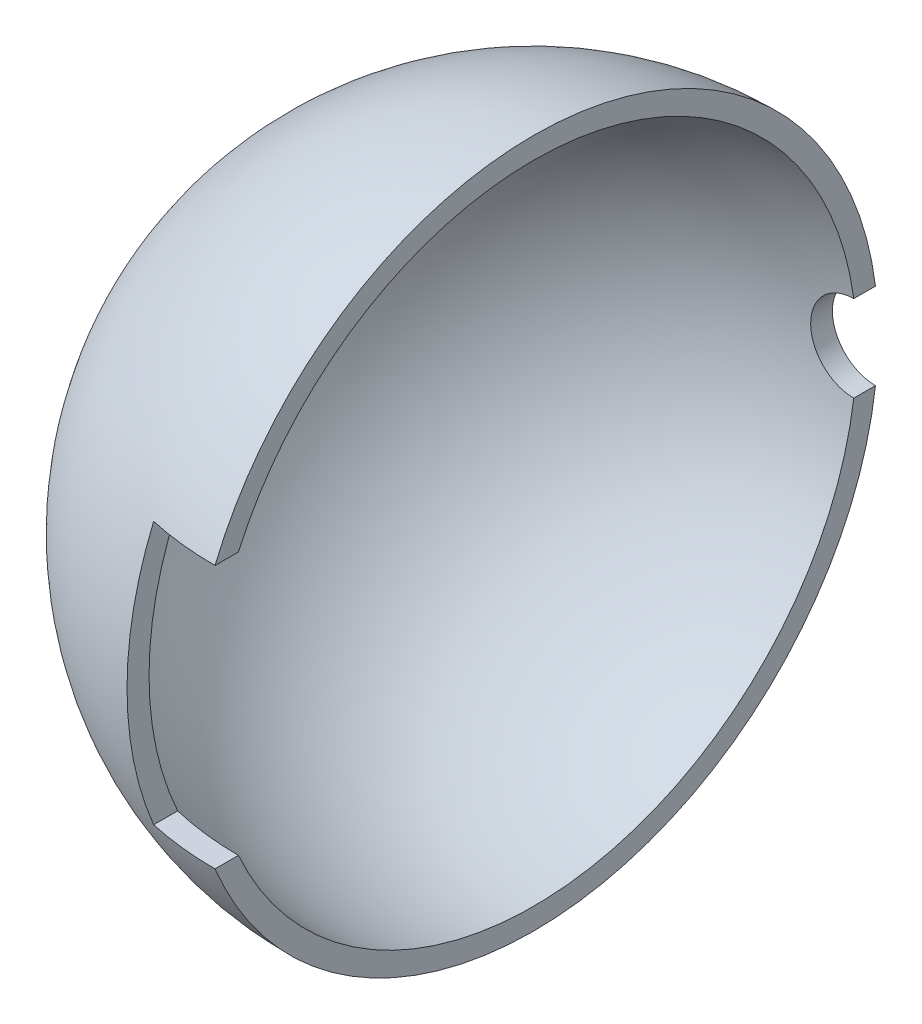
ISO-10303-21;
HEADER;
FILE_DESCRIPTION(('STEP AP214'),'2;1');
FILE_NAME('part.step','',(''),(''),'','','');
FILE_SCHEMA(('AUTOMOTIVE_DESIGN { 1 0 10303 214 1 1 1 1 }'));
ENDSEC;
DATA;
#1=APPLICATION_CONTEXT('core data for automotive mechanical design processes');
#2=APPLICATION_PROTOCOL_DEFINITION('international standard','automotive_design',2000,#1);
#3=PRODUCT_CONTEXT('',#1,'mechanical');
#4=PRODUCT('Part','Part','',(#3));
#5=PRODUCT_RELATED_PRODUCT_CATEGORY('part','',(#4));
#6=PRODUCT_DEFINITION_FORMATION('','',#4);
#7=PRODUCT_DEFINITION_CONTEXT('part definition',#1,'design');
#8=PRODUCT_DEFINITION('design','',#6,#7);
#9=PRODUCT_DEFINITION_SHAPE('','',#8);
#10=(LENGTH_UNIT() NAMED_UNIT(*) SI_UNIT(.MILLI.,.METRE.));
#11=(NAMED_UNIT(*) PLANE_ANGLE_UNIT() SI_UNIT($,.RADIAN.));
#12=(NAMED_UNIT(*) SI_UNIT($,.STERADIAN.) SOLID_ANGLE_UNIT());
#13=UNCERTAINTY_MEASURE_WITH_UNIT(LENGTH_MEASURE(1.E-05),#10,'distance_accuracy_value','');
#14=(GEOMETRIC_REPRESENTATION_CONTEXT(3) GLOBAL_UNCERTAINTY_ASSIGNED_CONTEXT((#13)) GLOBAL_UNIT_ASSIGNED_CONTEXT((#10,
#11,#12)) REPRESENTATION_CONTEXT('',''));
#15=CARTESIAN_POINT('',(0.,0.,0.));
#16=DIRECTION('',(0.,0.,1.));
#17=DIRECTION('',(1.,0.,0.));
#18=AXIS2_PLACEMENT_3D('',#15,#16,#17);
#19=CARTESIAN_POINT('',(0.,0.,0.));
#20=DIRECTION('',(-1.,0.,0.));
#21=DIRECTION('',(0.,1.,0.));
#22=AXIS2_PLACEMENT_3D('',#19,#20,#21);
#23=SPHERICAL_SURFACE('',#22,8.);
#24=CARTESIAN_POINT('',(0.,0.,-7.93725393319377));
#25=DIRECTION('',(0.,0.,1.));
#26=DIRECTION('',(1.,0.,0.));
#27=AXIS2_PLACEMENT_3D('',#24,#25,#26);
#28=CIRCLE('',#27,1.);
#29=CARTESIAN_POINT('',(0.,-1.,-7.93725393319373));
#30=VERTEX_POINT('',#29);
#31=CARTESIAN_POINT('',(0.,0.999999999999869,-7.93725393319377));
#32=VERTEX_POINT('',#31);
#33=EDGE_CURVE('E98',#30,#32,#28,.F.);
#34=ORIENTED_EDGE('',*,*,#33,.F.);
#35=CARTESIAN_POINT('',(0.,0.,0.));
#36=DIRECTION('',(-1.,0.,0.));
#37=DIRECTION('',(0.,-1.,0.));
#38=AXIS2_PLACEMENT_3D('',#35,#36,#37);
#39=CIRCLE('',#38,7.99999999999996);
#40=CARTESIAN_POINT('',(0.,-3.05,7.39577582137257));
#41=VERTEX_POINT('',#40);
#42=EDGE_CURVE('E135',#30,#41,#39,.T.);
#43=ORIENTED_EDGE('',*,*,#42,.T.);
#44=CARTESIAN_POINT('',(0.,-3.05,0.));
#45=DIRECTION('',(0.,-1.,0.));
#46=DIRECTION('',(0.,0.,-1.));
#47=AXIS2_PLACEMENT_3D('',#44,#45,#46);
#48=CIRCLE('',#47,7.39577582137263);
#49=CARTESIAN_POINT('',(-1.6,-3.05,7.22063016640514));
#50=VERTEX_POINT('',#49);
#51=EDGE_CURVE('E148',#41,#50,#48,.T.);
#52=ORIENTED_EDGE('',*,*,#51,.T.);
#53=CARTESIAN_POINT('',(-1.6,0.,0.));
#54=DIRECTION('',(-1.,0.,0.));
#55=DIRECTION('',(0.,0.,1.));
#56=AXIS2_PLACEMENT_3D('',#53,#54,#55);
#57=CIRCLE('',#56,7.83836717690617);
#58=CARTESIAN_POINT('',(-1.6,3.05,7.22063016640514));
#59=VERTEX_POINT('',#58);
#60=EDGE_CURVE('E144',#50,#59,#57,.T.);
#61=ORIENTED_EDGE('',*,*,#60,.T.);
#62=CARTESIAN_POINT('',(0.,3.05,0.));
#63=DIRECTION('',(0.,1.,0.));
#64=DIRECTION('',(0.,0.,1.));
#65=AXIS2_PLACEMENT_3D('',#62,#63,#64);
#66=CIRCLE('',#65,7.39577582137263);
#67=CARTESIAN_POINT('',(0.,3.05,7.39577582137261));
#68=VERTEX_POINT('',#67);
#69=EDGE_CURVE('E155',#59,#68,#66,.T.);
#70=ORIENTED_EDGE('',*,*,#69,.T.);
#71=EDGE_CURVE('E120',#68,#32,#39,.T.);
#72=ORIENTED_EDGE('',*,*,#71,.T.);
#73=EDGE_LOOP('',(#34,#43,#52,#61,#70,#72));
#74=FACE_BOUND('',#73,.T.);
#75=ADVANCED_FACE('F45',(#74),#23,.T.);
#76=CARTESIAN_POINT('',(0.,0.,0.));
#77=DIRECTION('',(-1.,0.,0.));
#78=DIRECTION('',(0.,1.,0.));
#79=AXIS2_PLACEMENT_3D('',#76,#77,#78);
#80=SPHERICAL_SURFACE('',#79,7.5);
#81=CARTESIAN_POINT('',(0.,0.,-7.43303437365925));
#82=DIRECTION('',(0.,0.,1.));
#83=DIRECTION('',(1.,0.,0.));
#84=AXIS2_PLACEMENT_3D('',#81,#82,#83);
#85=CIRCLE('',#84,1.);
#86=CARTESIAN_POINT('',(0.,-0.999999999999994,-7.43303437365921));
#87=VERTEX_POINT('',#86);
#88=CARTESIAN_POINT('',(0.,0.999999999999999,-7.43303437365925));
#89=VERTEX_POINT('',#88);
#90=EDGE_CURVE('E59',#87,#89,#85,.F.);
#91=ORIENTED_EDGE('',*,*,#90,.T.);
#92=CARTESIAN_POINT('',(0.,0.,0.));
#93=DIRECTION('',(-1.,0.,0.));
#94=DIRECTION('',(0.,-1.,0.));
#95=AXIS2_PLACEMENT_3D('',#92,#93,#94);
#96=CIRCLE('',#95,7.49999999999996);
#97=CARTESIAN_POINT('',(0.,3.05,6.85182457452025));
#98=VERTEX_POINT('',#97);
#99=EDGE_CURVE('E107',#98,#89,#96,.T.);
#100=ORIENTED_EDGE('',*,*,#99,.F.);
#101=CARTESIAN_POINT('',(0.,3.05,0.));
#102=DIRECTION('',(0.,1.,0.));
#103=DIRECTION('',(0.,0.,1.));
#104=AXIS2_PLACEMENT_3D('',#101,#102,#103);
#105=CIRCLE('',#104,6.85182457452028);
#106=CARTESIAN_POINT('',(-1.6,3.05,6.66239446445495));
#107=VERTEX_POINT('',#106);
#108=EDGE_CURVE('E67',#98,#107,#105,.F.);
#109=ORIENTED_EDGE('',*,*,#108,.T.);
#110=CARTESIAN_POINT('',(-1.6,0.,0.));
#111=DIRECTION('',(-1.,0.,0.));
#112=DIRECTION('',(0.,0.,1.));
#113=AXIS2_PLACEMENT_3D('',#110,#111,#112);
#114=CIRCLE('',#113,7.32734604068895);
#115=CARTESIAN_POINT('',(-1.6,-3.05,6.66239446445495));
#116=VERTEX_POINT('',#115);
#117=EDGE_CURVE('E127',#107,#116,#114,.F.);
#118=ORIENTED_EDGE('',*,*,#117,.T.);
#119=CARTESIAN_POINT('',(0.,-3.05,0.));
#120=DIRECTION('',(0.,-1.,0.));
#121=DIRECTION('',(0.,0.,-1.));
#122=AXIS2_PLACEMENT_3D('',#119,#120,#121);
#123=CIRCLE('',#122,6.85182457452028);
#124=CARTESIAN_POINT('',(0.,-3.05,6.85182457452022));
#125=VERTEX_POINT('',#124);
#126=EDGE_CURVE('E150',#116,#125,#123,.F.);
#127=ORIENTED_EDGE('',*,*,#126,.T.);
#128=EDGE_CURVE('E109',#87,#125,#96,.T.);
#129=ORIENTED_EDGE('',*,*,#128,.F.);
#130=EDGE_LOOP('',(#91,#100,#109,#118,#127,#129));
#131=FACE_BOUND('',#130,.T.);
#132=ADVANCED_FACE('F106',(#131),#80,.F.);
#133=CARTESIAN_POINT('',(0.,8.,0.));
#134=DIRECTION('',(-1.,0.,0.));
#135=DIRECTION('',(0.,-1.,0.));
#136=AXIS2_PLACEMENT_3D('',#133,#134,#135);
#137=PLANE('',#136);
#138=DIRECTION('',(0.,0.,-1.));
#139=VECTOR('',#138,1.);
#140=CARTESIAN_POINT('',(0.,1.,7.83936717690617));
#141=LINE('',#140,#139);
#142=EDGE_CURVE('E11',#32,#89,#141,.F.);
#143=ORIENTED_EDGE('',*,*,#142,.F.);
#144=ORIENTED_EDGE('',*,*,#71,.F.);
#145=DIRECTION('',(0.,0.,-1.));
#146=VECTOR('',#145,1.);
#147=CARTESIAN_POINT('',(0.,3.05,0.));
#148=LINE('',#147,#146);
#149=EDGE_CURVE('E113',#68,#98,#148,.T.);
#150=ORIENTED_EDGE('',*,*,#149,.T.);
#151=ORIENTED_EDGE('',*,*,#99,.T.);
#152=EDGE_LOOP('',(#143,#144,#150,#151));
#153=FACE_BOUND('',#152,.T.);
#154=ADVANCED_FACE('F112',(#153),#137,.F.);
#155=DIRECTION('',(0.,0.,-1.));
#156=VECTOR('',#155,1.);
#157=CARTESIAN_POINT('',(0.,-1.,7.83936717690617));
#158=LINE('',#157,#156);
#159=EDGE_CURVE('E53',#87,#30,#158,.T.);
#160=ORIENTED_EDGE('',*,*,#159,.F.);
#161=ORIENTED_EDGE('',*,*,#128,.T.);
#162=DIRECTION('',(0.,0.,1.));
#163=VECTOR('',#162,1.);
#164=CARTESIAN_POINT('',(0.,-3.05,0.));
#165=LINE('',#164,#163);
#166=EDGE_CURVE('E118',#125,#41,#165,.T.);
#167=ORIENTED_EDGE('',*,*,#166,.T.);
#168=ORIENTED_EDGE('',*,*,#42,.F.);
#169=EDGE_LOOP('',(#160,#161,#167,#168));
#170=FACE_BOUND('',#169,.T.);
#171=ADVANCED_FACE('F141',(#170),#137,.F.);
#172=CARTESIAN_POINT('',(-1.6,-3.05,6.));
#173=DIRECTION('',(-1.,0.,0.));
#174=DIRECTION('',(0.,0.,1.));
#175=AXIS2_PLACEMENT_3D('',#172,#173,#174);
#176=PLANE('',#175);
#177=DIRECTION('',(0.,0.,1.));
#178=VECTOR('',#177,1.);
#179=CARTESIAN_POINT('',(-1.6,-3.05,6.));
#180=LINE('',#179,#178);
#181=EDGE_CURVE('E160',#116,#50,#180,.T.);
#182=ORIENTED_EDGE('',*,*,#181,.F.);
#183=ORIENTED_EDGE('',*,*,#117,.F.);
#184=DIRECTION('',(0.,0.,1.));
#185=VECTOR('',#184,1.);
#186=CARTESIAN_POINT('',(-1.6,3.05,6.));
#187=LINE('',#186,#185);
#188=EDGE_CURVE('E139',#107,#59,#187,.T.);
#189=ORIENTED_EDGE('',*,*,#188,.T.);
#190=ORIENTED_EDGE('',*,*,#60,.F.);
#191=EDGE_LOOP('',(#182,#183,#189,#190));
#192=FACE_BOUND('',#191,.T.);
#193=ADVANCED_FACE('F170',(#192),#176,.F.);
#194=CARTESIAN_POINT('',(-1.6,-3.05,6.));
#195=DIRECTION('',(0.,-1.,0.));
#196=DIRECTION('',(0.,0.,-1.));
#197=AXIS2_PLACEMENT_3D('',#194,#195,#196);
#198=PLANE('',#197);
#199=ORIENTED_EDGE('',*,*,#166,.F.);
#200=ORIENTED_EDGE('',*,*,#126,.F.);
#201=ORIENTED_EDGE('',*,*,#181,.T.);
#202=ORIENTED_EDGE('',*,*,#51,.F.);
#203=EDGE_LOOP('',(#199,#200,#201,#202));
#204=FACE_BOUND('',#203,.T.);
#205=ADVANCED_FACE('F168',(#204),#198,.F.);
#206=CARTESIAN_POINT('',(-1.6,3.05,6.));
#207=DIRECTION('',(0.,1.,0.));
#208=DIRECTION('',(0.,0.,1.));
#209=AXIS2_PLACEMENT_3D('',#206,#207,#208);
#210=PLANE('',#209);
#211=ORIENTED_EDGE('',*,*,#188,.F.);
#212=ORIENTED_EDGE('',*,*,#108,.F.);
#213=ORIENTED_EDGE('',*,*,#149,.F.);
#214=ORIENTED_EDGE('',*,*,#69,.F.);
#215=EDGE_LOOP('',(#211,#212,#213,#214));
#216=FACE_BOUND('',#215,.T.);
#217=ADVANCED_FACE('F171',(#216),#210,.F.);
#218=CARTESIAN_POINT('',(0.,0.,7.83936717690617));
#219=DIRECTION('',(0.,0.,-1.));
#220=DIRECTION('',(-1.,0.,0.));
#221=AXIS2_PLACEMENT_3D('',#218,#219,#220);
#222=CYLINDRICAL_SURFACE('',#221,1.);
#223=ORIENTED_EDGE('',*,*,#142,.T.);
#224=ORIENTED_EDGE('',*,*,#90,.F.);
#225=ORIENTED_EDGE('',*,*,#159,.T.);
#226=ORIENTED_EDGE('',*,*,#33,.T.);
#227=EDGE_LOOP('',(#223,#224,#225,#226));
#228=FACE_BOUND('',#227,.T.);
#229=ADVANCED_FACE('F96',(#228),#222,.F.);
#230=CLOSED_SHELL('',(#75,#132,#154,#171,#193,#205,#217,#229));
#231=MANIFOLD_SOLID_BREP('B2',#230);
#232=ADVANCED_BREP_SHAPE_REPRESENTATION('',(#18,#231),#14);
#233=SHAPE_DEFINITION_REPRESENTATION(#9,#232);
ENDSEC;
END-ISO-10303-21;
